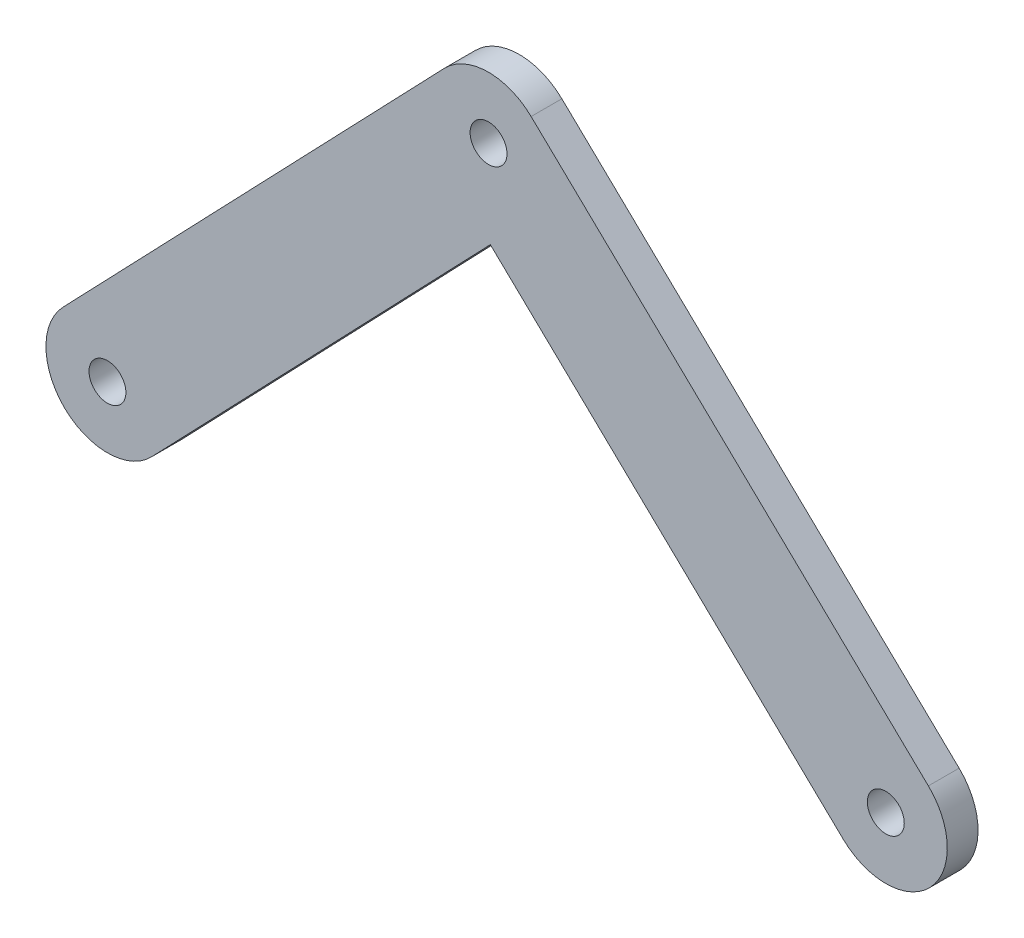
ISO-10303-21;
HEADER;
FILE_DESCRIPTION(('STEP AP214'),'2;1');
FILE_NAME('part.step','',(''),(''),'','','');
FILE_SCHEMA(('AUTOMOTIVE_DESIGN { 1 0 10303 214 1 1 1 1 }'));
ENDSEC;
DATA;
#1=APPLICATION_CONTEXT('core data for automotive mechanical design processes');
#2=APPLICATION_PROTOCOL_DEFINITION('international standard','automotive_design',2000,#1);
#3=PRODUCT_CONTEXT('',#1,'mechanical');
#4=PRODUCT('Part','Part','',(#3));
#5=PRODUCT_RELATED_PRODUCT_CATEGORY('part','',(#4));
#6=PRODUCT_DEFINITION_FORMATION('','',#4);
#7=PRODUCT_DEFINITION_CONTEXT('part definition',#1,'design');
#8=PRODUCT_DEFINITION('design','',#6,#7);
#9=PRODUCT_DEFINITION_SHAPE('','',#8);
#10=(LENGTH_UNIT() NAMED_UNIT(*) SI_UNIT(.MILLI.,.METRE.));
#11=(NAMED_UNIT(*) PLANE_ANGLE_UNIT() SI_UNIT($,.RADIAN.));
#12=(NAMED_UNIT(*) SI_UNIT($,.STERADIAN.) SOLID_ANGLE_UNIT());
#13=UNCERTAINTY_MEASURE_WITH_UNIT(LENGTH_MEASURE(1.E-05),#10,'distance_accuracy_value','');
#14=(GEOMETRIC_REPRESENTATION_CONTEXT(3) GLOBAL_UNCERTAINTY_ASSIGNED_CONTEXT((#13)) GLOBAL_UNIT_ASSIGNED_CONTEXT((#10,
#11,#12)) REPRESENTATION_CONTEXT('',''));
#15=CARTESIAN_POINT('',(0.,0.,0.));
#16=DIRECTION('',(0.,0.,1.));
#17=DIRECTION('',(1.,0.,0.));
#18=AXIS2_PLACEMENT_3D('',#15,#16,#17);
#19=CARTESIAN_POINT('',(-61.9728450802194,-64.6059856906079,5.));
#20=DIRECTION('',(0.,0.,1.));
#21=DIRECTION('',(1.,0.,0.));
#22=AXIS2_PLACEMENT_3D('',#19,#20,#21);
#23=PLANE('',#22);
#24=CARTESIAN_POINT('',(0.,0.,5.));
#25=DIRECTION('',(0.,0.,1.));
#26=DIRECTION('',(1.,0.,0.));
#27=AXIS2_PLACEMENT_3D('',#24,#25,#26);
#28=CIRCLE('',#27,3.);
#29=CARTESIAN_POINT('',(3.,0.,5.));
#30=VERTEX_POINT('',#29);
#31=EDGE_CURVE('E163',#30,#30,#28,.T.);
#32=ORIENTED_EDGE('',*,*,#31,.F.);
#33=EDGE_LOOP('',(#32));
#34=FACE_BOUND('',#33,.T.);
#35=CARTESIAN_POINT('',(-61.9728450802194,-64.6059856906079,5.));
#36=DIRECTION('',(0.,0.,1.));
#37=DIRECTION('',(1.,0.,0.));
#38=AXIS2_PLACEMENT_3D('',#35,#36,#37);
#39=CIRCLE('',#38,9.99999999999999);
#40=CARTESIAN_POINT('',(-69.1894466301897,-57.6835105502433,5.));
#41=VERTEX_POINT('',#40);
#42=CARTESIAN_POINT('',(-54.7562435302491,-71.5284608309724,5.));
#43=VERTEX_POINT('',#42);
#44=EDGE_CURVE('E136',#41,#43,#39,.T.);
#45=ORIENTED_EDGE('',*,*,#44,.T.);
#46=DIRECTION('',(0.692247514036459,0.721660154997034,0.));
#47=VECTOR('',#46,1.);
#48=CARTESIAN_POINT('',(0.294126409605775,-14.1390766903349,5.));
#49=LINE('',#48,#47);
#50=CARTESIAN_POINT('',(0.294126409605775,-14.1390766903349,5.));
#51=VERTEX_POINT('',#50);
#52=EDGE_CURVE('E89',#43,#51,#49,.T.);
#53=ORIENTED_EDGE('',*,*,#52,.T.);
#54=DIRECTION('',(0.721660154997037,-0.692247514036456,0.));
#55=VECTOR('',#54,1.);
#56=CARTESIAN_POINT('',(0.294126409605775,-14.1390766903349,5.));
#57=LINE('',#56,#55);
#58=CARTESIAN_POINT('',(57.6805419349701,-69.1865990065139,5.));
#59=VERTEX_POINT('',#58);
#60=EDGE_CURVE('E148',#51,#59,#57,.T.);
#61=ORIENTED_EDGE('',*,*,#60,.T.);
#62=CARTESIAN_POINT('',(64.6030170753347,-61.9699974565435,5.));
#63=DIRECTION('',(0.,0.,1.));
#64=DIRECTION('',(1.,0.,0.));
#65=AXIS2_PLACEMENT_3D('',#62,#63,#64);
#66=CIRCLE('',#65,9.99999999999999);
#67=CARTESIAN_POINT('',(71.5254922156992,-54.7533959065732,5.));
#68=VERTEX_POINT('',#67);
#69=EDGE_CURVE('E105',#59,#68,#66,.T.);
#70=ORIENTED_EDGE('',*,*,#69,.T.);
#71=DIRECTION('',(-0.721660154997036,0.692247514036456,0.));
#72=VECTOR('',#71,1.);
#73=CARTESIAN_POINT('',(6.92247514036456,7.21660154997037,5.));
#74=LINE('',#73,#72);
#75=CARTESIAN_POINT('',(6.92247514036456,7.21660154997037,5.));
#76=VERTEX_POINT('',#75);
#77=EDGE_CURVE('E99',#68,#76,#74,.T.);
#78=ORIENTED_EDGE('',*,*,#77,.T.);
#79=CARTESIAN_POINT('',(0.,0.,5.));
#80=DIRECTION('',(0.,0.,1.));
#81=DIRECTION('',(1.,0.,0.));
#82=AXIS2_PLACEMENT_3D('',#79,#80,#81);
#83=CIRCLE('',#82,10.);
#84=CARTESIAN_POINT('',(-7.21660154997035,6.92247514036459,5.));
#85=VERTEX_POINT('',#84);
#86=EDGE_CURVE('E103',#76,#85,#83,.T.);
#87=ORIENTED_EDGE('',*,*,#86,.T.);
#88=DIRECTION('',(-0.692247514036459,-0.721660154997034,0.));
#89=VECTOR('',#88,1.);
#90=CARTESIAN_POINT('',(-7.21660154997034,6.92247514036459,5.));
#91=LINE('',#90,#89);
#92=EDGE_CURVE('E49',#85,#41,#91,.T.);
#93=ORIENTED_EDGE('',*,*,#92,.T.);
#94=EDGE_LOOP('',(#45,#53,#61,#70,#78,#87,#93));
#95=FACE_BOUND('',#94,.T.);
#96=CARTESIAN_POINT('',(-61.9728450802194,-64.6059856906079,5.));
#97=DIRECTION('',(0.,0.,1.));
#98=DIRECTION('',(1.,0.,0.));
#99=AXIS2_PLACEMENT_3D('',#96,#97,#98);
#100=CIRCLE('',#99,3.);
#101=CARTESIAN_POINT('',(-58.9728450802194,-64.6059856906079,5.));
#102=VERTEX_POINT('',#101);
#103=EDGE_CURVE('E127',#102,#102,#100,.T.);
#104=ORIENTED_EDGE('',*,*,#103,.F.);
#105=EDGE_LOOP('',(#104));
#106=FACE_BOUND('',#105,.T.);
#107=CARTESIAN_POINT('',(64.6030170753347,-61.9699974565435,5.));
#108=DIRECTION('',(0.,0.,1.));
#109=DIRECTION('',(1.,0.,0.));
#110=AXIS2_PLACEMENT_3D('',#107,#108,#109);
#111=CIRCLE('',#110,3.00000000000001);
#112=CARTESIAN_POINT('',(67.6030170753347,-61.9699974565435,5.));
#113=VERTEX_POINT('',#112);
#114=EDGE_CURVE('E169',#113,#113,#111,.T.);
#115=ORIENTED_EDGE('',*,*,#114,.F.);
#116=EDGE_LOOP('',(#115));
#117=FACE_BOUND('',#116,.T.);
#118=ADVANCED_FACE('F32',(#34,#95,#106,#117),#23,.T.);
#119=CARTESIAN_POINT('',(-61.9728450802194,-64.6059856906079,0.));
#120=DIRECTION('',(0.,0.,1.));
#121=DIRECTION('',(1.,0.,0.));
#122=AXIS2_PLACEMENT_3D('',#119,#120,#121);
#123=PLANE('',#122);
#124=CARTESIAN_POINT('',(-61.9728450802194,-64.6059856906079,0.));
#125=DIRECTION('',(0.,0.,1.));
#126=DIRECTION('',(1.,0.,0.));
#127=AXIS2_PLACEMENT_3D('',#124,#125,#126);
#128=CIRCLE('',#127,9.99999999999999);
#129=CARTESIAN_POINT('',(-69.1894466301897,-57.6835105502433,0.));
#130=VERTEX_POINT('',#129);
#131=CARTESIAN_POINT('',(-54.7562435302491,-71.5284608309724,0.));
#132=VERTEX_POINT('',#131);
#133=EDGE_CURVE('E123',#130,#132,#128,.T.);
#134=ORIENTED_EDGE('',*,*,#133,.F.);
#135=DIRECTION('',(-0.692247514036459,-0.721660154997034,0.));
#136=VECTOR('',#135,1.);
#137=CARTESIAN_POINT('',(-7.21660154997034,6.92247514036459,0.));
#138=LINE('',#137,#136);
#139=CARTESIAN_POINT('',(-7.21660154997035,6.92247514036459,0.));
#140=VERTEX_POINT('',#139);
#141=EDGE_CURVE('E81',#140,#130,#138,.T.);
#142=ORIENTED_EDGE('',*,*,#141,.F.);
#143=CARTESIAN_POINT('',(0.,0.,0.));
#144=DIRECTION('',(0.,0.,1.));
#145=DIRECTION('',(1.,0.,0.));
#146=AXIS2_PLACEMENT_3D('',#143,#144,#145);
#147=CIRCLE('',#146,10.);
#148=CARTESIAN_POINT('',(6.92247514036456,7.21660154997037,0.));
#149=VERTEX_POINT('',#148);
#150=EDGE_CURVE('E75',#149,#140,#147,.T.);
#151=ORIENTED_EDGE('',*,*,#150,.F.);
#152=DIRECTION('',(-0.721660154997036,0.692247514036456,0.));
#153=VECTOR('',#152,1.);
#154=CARTESIAN_POINT('',(6.92247514036456,7.21660154997037,0.));
#155=LINE('',#154,#153);
#156=CARTESIAN_POINT('',(71.5254922156992,-54.7533959065732,0.));
#157=VERTEX_POINT('',#156);
#158=EDGE_CURVE('E113',#157,#149,#155,.T.);
#159=ORIENTED_EDGE('',*,*,#158,.F.);
#160=CARTESIAN_POINT('',(64.6030170753347,-61.9699974565435,0.));
#161=DIRECTION('',(0.,0.,1.));
#162=DIRECTION('',(1.,0.,0.));
#163=AXIS2_PLACEMENT_3D('',#160,#161,#162);
#164=CIRCLE('',#163,9.99999999999999);
#165=CARTESIAN_POINT('',(57.6805419349701,-69.1865990065139,0.));
#166=VERTEX_POINT('',#165);
#167=EDGE_CURVE('E131',#166,#157,#164,.T.);
#168=ORIENTED_EDGE('',*,*,#167,.F.);
#169=DIRECTION('',(0.721660154997037,-0.692247514036456,0.));
#170=VECTOR('',#169,1.);
#171=CARTESIAN_POINT('',(0.294126409605775,-14.1390766903349,0.));
#172=LINE('',#171,#170);
#173=CARTESIAN_POINT('',(0.294126409605775,-14.1390766903349,0.));
#174=VERTEX_POINT('',#173);
#175=EDGE_CURVE('E129',#174,#166,#172,.T.);
#176=ORIENTED_EDGE('',*,*,#175,.F.);
#177=DIRECTION('',(0.692247514036459,0.721660154997034,0.));
#178=VECTOR('',#177,1.);
#179=CARTESIAN_POINT('',(0.294126409605775,-14.1390766903349,0.));
#180=LINE('',#179,#178);
#181=EDGE_CURVE('E126',#132,#174,#180,.T.);
#182=ORIENTED_EDGE('',*,*,#181,.F.);
#183=EDGE_LOOP('',(#134,#142,#151,#159,#168,#176,#182));
#184=FACE_BOUND('',#183,.T.);
#185=CARTESIAN_POINT('',(-61.9728450802194,-64.6059856906079,0.));
#186=DIRECTION('',(0.,0.,1.));
#187=DIRECTION('',(1.,0.,0.));
#188=AXIS2_PLACEMENT_3D('',#185,#186,#187);
#189=CIRCLE('',#188,3.);
#190=CARTESIAN_POINT('',(-58.9728450802194,-64.6059856906079,0.));
#191=VERTEX_POINT('',#190);
#192=EDGE_CURVE('E160',#191,#191,#189,.T.);
#193=ORIENTED_EDGE('',*,*,#192,.T.);
#194=EDGE_LOOP('',(#193));
#195=FACE_BOUND('',#194,.T.);
#196=CARTESIAN_POINT('',(0.,0.,0.));
#197=DIRECTION('',(0.,0.,1.));
#198=DIRECTION('',(1.,0.,0.));
#199=AXIS2_PLACEMENT_3D('',#196,#197,#198);
#200=CIRCLE('',#199,3.);
#201=CARTESIAN_POINT('',(3.,0.,0.));
#202=VERTEX_POINT('',#201);
#203=EDGE_CURVE('E166',#202,#202,#200,.T.);
#204=ORIENTED_EDGE('',*,*,#203,.T.);
#205=EDGE_LOOP('',(#204));
#206=FACE_BOUND('',#205,.T.);
#207=CARTESIAN_POINT('',(64.6030170753347,-61.9699974565435,0.));
#208=DIRECTION('',(0.,0.,1.));
#209=DIRECTION('',(1.,0.,0.));
#210=AXIS2_PLACEMENT_3D('',#207,#208,#209);
#211=CIRCLE('',#210,3.00000000000001);
#212=CARTESIAN_POINT('',(67.6030170753347,-61.9699974565435,0.));
#213=VERTEX_POINT('',#212);
#214=EDGE_CURVE('E172',#213,#213,#211,.T.);
#215=ORIENTED_EDGE('',*,*,#214,.T.);
#216=EDGE_LOOP('',(#215));
#217=FACE_BOUND('',#216,.T.);
#218=ADVANCED_FACE('F152',(#184,#195,#206,#217),#123,.F.);
#219=CARTESIAN_POINT('',(-61.9728450802194,-64.6059856906079,5.));
#220=DIRECTION('',(0.,0.,-1.));
#221=DIRECTION('',(-1.,0.,0.));
#222=AXIS2_PLACEMENT_3D('',#219,#220,#221);
#223=CYLINDRICAL_SURFACE('',#222,9.99999999999999);
#224=ORIENTED_EDGE('',*,*,#133,.T.);
#225=DIRECTION('',(0.,0.,-1.));
#226=VECTOR('',#225,1.);
#227=CARTESIAN_POINT('',(-54.7562435302491,-71.5284608309724,5.));
#228=LINE('',#227,#226);
#229=EDGE_CURVE('E11',#43,#132,#228,.T.);
#230=ORIENTED_EDGE('',*,*,#229,.F.);
#231=ORIENTED_EDGE('',*,*,#44,.F.);
#232=DIRECTION('',(0.,0.,-1.));
#233=VECTOR('',#232,1.);
#234=CARTESIAN_POINT('',(-69.1894466301897,-57.6835105502433,5.));
#235=LINE('',#234,#233);
#236=EDGE_CURVE('E119',#41,#130,#235,.T.);
#237=ORIENTED_EDGE('',*,*,#236,.T.);
#238=EDGE_LOOP('',(#224,#230,#231,#237));
#239=FACE_BOUND('',#238,.T.);
#240=ADVANCED_FACE('F34',(#239),#223,.T.);
#241=CARTESIAN_POINT('',(0.294126409605775,-14.1390766903349,5.));
#242=DIRECTION('',(-0.721660154997034,0.692247514036459,0.));
#243=DIRECTION('',(-0.692247514036459,-0.721660154997034,0.));
#244=AXIS2_PLACEMENT_3D('',#241,#242,#243);
#245=PLANE('',#244);
#246=ORIENTED_EDGE('',*,*,#181,.T.);
#247=DIRECTION('',(0.,0.,-1.));
#248=VECTOR('',#247,1.);
#249=CARTESIAN_POINT('',(0.294126409605775,-14.1390766903349,5.));
#250=LINE('',#249,#248);
#251=EDGE_CURVE('E41',#51,#174,#250,.T.);
#252=ORIENTED_EDGE('',*,*,#251,.F.);
#253=ORIENTED_EDGE('',*,*,#52,.F.);
#254=ORIENTED_EDGE('',*,*,#229,.T.);
#255=EDGE_LOOP('',(#246,#252,#253,#254));
#256=FACE_BOUND('',#255,.T.);
#257=ADVANCED_FACE('F203',(#256),#245,.F.);
#258=CARTESIAN_POINT('',(0.294126409605775,-14.1390766903349,5.));
#259=DIRECTION('',(0.692247514036456,0.721660154997037,0.));
#260=DIRECTION('',(-0.721660154997037,0.692247514036456,0.));
#261=AXIS2_PLACEMENT_3D('',#258,#259,#260);
#262=PLANE('',#261);
#263=ORIENTED_EDGE('',*,*,#175,.T.);
#264=DIRECTION('',(0.,0.,-1.));
#265=VECTOR('',#264,1.);
#266=CARTESIAN_POINT('',(57.6805419349701,-69.1865990065139,5.));
#267=LINE('',#266,#265);
#268=EDGE_CURVE('E140',#59,#166,#267,.T.);
#269=ORIENTED_EDGE('',*,*,#268,.F.);
#270=ORIENTED_EDGE('',*,*,#60,.F.);
#271=ORIENTED_EDGE('',*,*,#251,.T.);
#272=EDGE_LOOP('',(#263,#269,#270,#271));
#273=FACE_BOUND('',#272,.T.);
#274=ADVANCED_FACE('F146',(#273),#262,.F.);
#275=CARTESIAN_POINT('',(64.6030170753347,-61.9699974565435,5.));
#276=DIRECTION('',(0.,0.,-1.));
#277=DIRECTION('',(-1.,0.,0.));
#278=AXIS2_PLACEMENT_3D('',#275,#276,#277);
#279=CYLINDRICAL_SURFACE('',#278,9.99999999999999);
#280=ORIENTED_EDGE('',*,*,#167,.T.);
#281=DIRECTION('',(0.,0.,-1.));
#282=VECTOR('',#281,1.);
#283=CARTESIAN_POINT('',(71.5254922156992,-54.7533959065732,5.));
#284=LINE('',#283,#282);
#285=EDGE_CURVE('E114',#68,#157,#284,.T.);
#286=ORIENTED_EDGE('',*,*,#285,.F.);
#287=ORIENTED_EDGE('',*,*,#69,.F.);
#288=ORIENTED_EDGE('',*,*,#268,.T.);
#289=EDGE_LOOP('',(#280,#286,#287,#288));
#290=FACE_BOUND('',#289,.T.);
#291=ADVANCED_FACE('F155',(#290),#279,.T.);
#292=CARTESIAN_POINT('',(6.92247514036456,7.21660154997037,5.));
#293=DIRECTION('',(-0.692247514036456,-0.721660154997036,0.));
#294=DIRECTION('',(0.721660154997036,-0.692247514036456,0.));
#295=AXIS2_PLACEMENT_3D('',#292,#293,#294);
#296=PLANE('',#295);
#297=ORIENTED_EDGE('',*,*,#158,.T.);
#298=DIRECTION('',(0.,0.,-1.));
#299=VECTOR('',#298,1.);
#300=CARTESIAN_POINT('',(6.92247514036456,7.21660154997037,5.));
#301=LINE('',#300,#299);
#302=EDGE_CURVE('E110',#76,#149,#301,.T.);
#303=ORIENTED_EDGE('',*,*,#302,.F.);
#304=ORIENTED_EDGE('',*,*,#77,.F.);
#305=ORIENTED_EDGE('',*,*,#285,.T.);
#306=EDGE_LOOP('',(#297,#303,#304,#305));
#307=FACE_BOUND('',#306,.T.);
#308=ADVANCED_FACE('F111',(#307),#296,.F.);
#309=CARTESIAN_POINT('',(0.,0.,5.));
#310=DIRECTION('',(0.,0.,-1.));
#311=DIRECTION('',(-1.,0.,0.));
#312=AXIS2_PLACEMENT_3D('',#309,#310,#311);
#313=CYLINDRICAL_SURFACE('',#312,10.);
#314=ORIENTED_EDGE('',*,*,#150,.T.);
#315=DIRECTION('',(0.,0.,-1.));
#316=VECTOR('',#315,1.);
#317=CARTESIAN_POINT('',(-7.21660154997035,6.92247514036459,5.));
#318=LINE('',#317,#316);
#319=EDGE_CURVE('E115',#85,#140,#318,.T.);
#320=ORIENTED_EDGE('',*,*,#319,.F.);
#321=ORIENTED_EDGE('',*,*,#86,.F.);
#322=ORIENTED_EDGE('',*,*,#302,.T.);
#323=EDGE_LOOP('',(#314,#320,#321,#322));
#324=FACE_BOUND('',#323,.T.);
#325=ADVANCED_FACE('F117',(#324),#313,.T.);
#326=CARTESIAN_POINT('',(-7.21660154997034,6.92247514036459,5.));
#327=DIRECTION('',(0.721660154997034,-0.692247514036459,0.));
#328=DIRECTION('',(0.692247514036459,0.721660154997034,0.));
#329=AXIS2_PLACEMENT_3D('',#326,#327,#328);
#330=PLANE('',#329);
#331=ORIENTED_EDGE('',*,*,#141,.T.);
#332=ORIENTED_EDGE('',*,*,#236,.F.);
#333=ORIENTED_EDGE('',*,*,#92,.F.);
#334=ORIENTED_EDGE('',*,*,#319,.T.);
#335=EDGE_LOOP('',(#331,#332,#333,#334));
#336=FACE_BOUND('',#335,.T.);
#337=ADVANCED_FACE('F193',(#336),#330,.F.);
#338=CARTESIAN_POINT('',(-61.9728450802194,-64.6059856906079,5.));
#339=DIRECTION('',(0.,0.,-1.));
#340=DIRECTION('',(-1.,0.,0.));
#341=AXIS2_PLACEMENT_3D('',#338,#339,#340);
#342=CYLINDRICAL_SURFACE('',#341,3.);
#343=ORIENTED_EDGE('',*,*,#103,.T.);
#344=EDGE_LOOP('',(#343));
#345=FACE_BOUND('',#344,.T.);
#346=ORIENTED_EDGE('',*,*,#192,.F.);
#347=EDGE_LOOP('',(#346));
#348=FACE_BOUND('',#347,.T.);
#349=ADVANCED_FACE('F190',(#345,#348),#342,.F.);
#350=CARTESIAN_POINT('',(0.,0.,5.));
#351=DIRECTION('',(0.,0.,-1.));
#352=DIRECTION('',(-1.,0.,0.));
#353=AXIS2_PLACEMENT_3D('',#350,#351,#352);
#354=CYLINDRICAL_SURFACE('',#353,3.);
#355=ORIENTED_EDGE('',*,*,#31,.T.);
#356=EDGE_LOOP('',(#355));
#357=FACE_BOUND('',#356,.T.);
#358=ORIENTED_EDGE('',*,*,#203,.F.);
#359=EDGE_LOOP('',(#358));
#360=FACE_BOUND('',#359,.T.);
#361=ADVANCED_FACE('F262',(#357,#360),#354,.F.);
#362=CARTESIAN_POINT('',(64.6030170753347,-61.9699974565435,5.));
#363=DIRECTION('',(0.,0.,-1.));
#364=DIRECTION('',(-1.,0.,0.));
#365=AXIS2_PLACEMENT_3D('',#362,#363,#364);
#366=CYLINDRICAL_SURFACE('',#365,3.00000000000001);
#367=ORIENTED_EDGE('',*,*,#114,.T.);
#368=EDGE_LOOP('',(#367));
#369=FACE_BOUND('',#368,.T.);
#370=ORIENTED_EDGE('',*,*,#214,.F.);
#371=EDGE_LOOP('',(#370));
#372=FACE_BOUND('',#371,.T.);
#373=ADVANCED_FACE('F178',(#369,#372),#366,.F.);
#374=CLOSED_SHELL('',(#118,#218,#240,#257,#274,#291,#308,#325,#337,#349,#361,#373));
#375=MANIFOLD_SOLID_BREP('B2',#374);
#376=ADVANCED_BREP_SHAPE_REPRESENTATION('',(#18,#375),#14);
#377=SHAPE_DEFINITION_REPRESENTATION(#9,#376);
ENDSEC;
END-ISO-10303-21;
